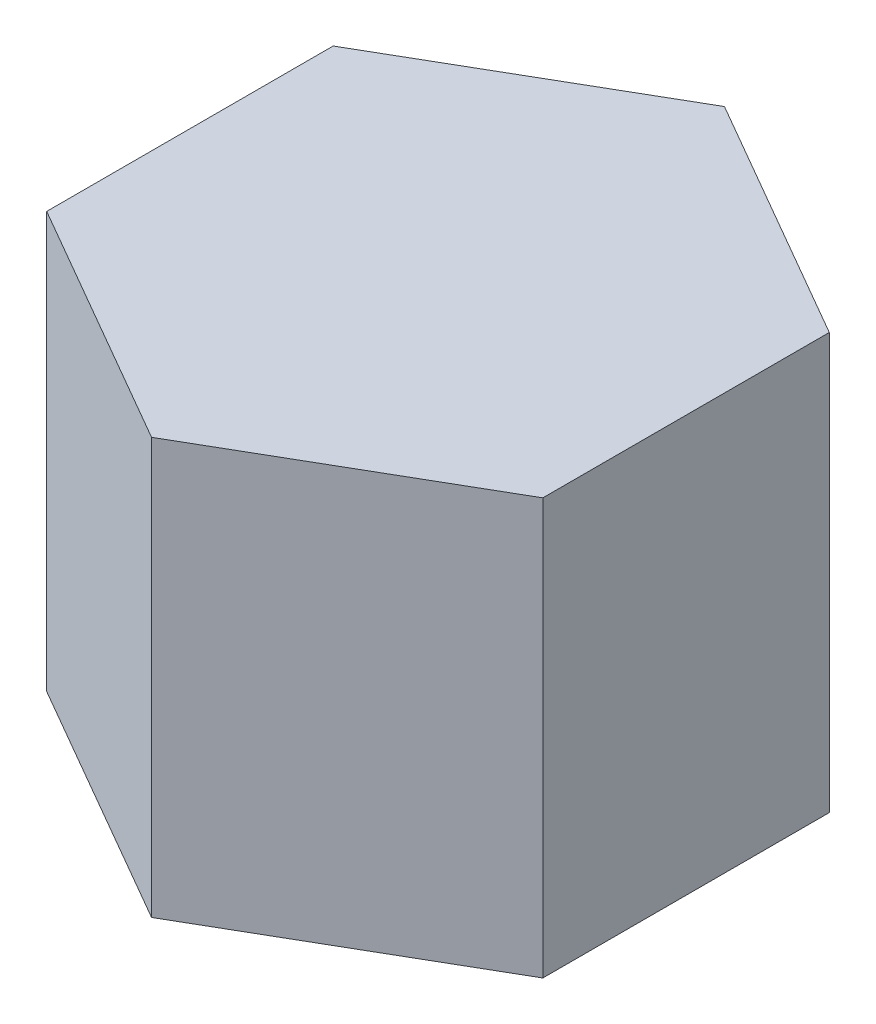
ISO-10303-21;
HEADER;
FILE_DESCRIPTION(('STEP AP214'),'2;1');
FILE_NAME('part.step','',(''),(''),'','','');
FILE_SCHEMA(('AUTOMOTIVE_DESIGN { 1 0 10303 214 1 1 1 1 }'));
ENDSEC;
DATA;
#1=APPLICATION_CONTEXT('core data for automotive mechanical design processes');
#2=APPLICATION_PROTOCOL_DEFINITION('international standard','automotive_design',2000,#1);
#3=PRODUCT_CONTEXT('',#1,'mechanical');
#4=PRODUCT('Part','Part','',(#3));
#5=PRODUCT_RELATED_PRODUCT_CATEGORY('part','',(#4));
#6=PRODUCT_DEFINITION_FORMATION('','',#4);
#7=PRODUCT_DEFINITION_CONTEXT('part definition',#1,'design');
#8=PRODUCT_DEFINITION('design','',#6,#7);
#9=PRODUCT_DEFINITION_SHAPE('','',#8);
#10=(LENGTH_UNIT() NAMED_UNIT(*) SI_UNIT(.MILLI.,.METRE.));
#11=(NAMED_UNIT(*) PLANE_ANGLE_UNIT() SI_UNIT($,.RADIAN.));
#12=(NAMED_UNIT(*) SI_UNIT($,.STERADIAN.) SOLID_ANGLE_UNIT());
#13=UNCERTAINTY_MEASURE_WITH_UNIT(LENGTH_MEASURE(1.E-05),#10,'distance_accuracy_value','');
#14=(GEOMETRIC_REPRESENTATION_CONTEXT(3) GLOBAL_UNCERTAINTY_ASSIGNED_CONTEXT((#13)) GLOBAL_UNIT_ASSIGNED_CONTEXT((#10,
#11,#12)) REPRESENTATION_CONTEXT('',''));
#15=CARTESIAN_POINT('',(0.,0.,0.));
#16=DIRECTION('',(0.,0.,1.));
#17=DIRECTION('',(1.,0.,0.));
#18=AXIS2_PLACEMENT_3D('',#15,#16,#17);
#19=CARTESIAN_POINT('',(211.142660308706,-148.537700895744,292.372996624279));
#20=DIRECTION('',(-0.499999999999943,0.,-0.866025403784472));
#21=DIRECTION('',(-0.866025403784472,0.,0.499999999999943));
#22=AXIS2_PLACEMENT_3D('',#19,#20,#21);
#23=PLANE('',#22);
#24=CARTESIAN_POINT('',(210.839551417382,-149.045793579175,292.547996624279));
#25=DIRECTION('',(0.866025403784471,0.,-0.499999999999943));
#26=VECTOR('',#25,1.);
#27=LINE('',#24,#26);
#28=CARTESIAN_POINT('',(210.839551417382,-149.045793579175,292.547996624279));
#29=VERTEX_POINT('',#28);
#30=CARTESIAN_POINT('',(211.142660308706,-149.045793579175,292.372996624279));
#31=VERTEX_POINT('',#30);
#32=EDGE_CURVE('E170',#29,#31,#27,.T.);
#33=ORIENTED_EDGE('',*,*,#32,.T.);
#34=CARTESIAN_POINT('',(211.142660308706,-148.537700895744,292.372996624279));
#35=DIRECTION('',(0.,-1.,0.));
#36=VECTOR('',#35,1.);
#37=LINE('',#34,#36);
#38=CARTESIAN_POINT('',(211.142660308706,-148.537700895744,292.372996624279));
#39=VERTEX_POINT('',#38);
#40=EDGE_CURVE('E35',#39,#31,#37,.T.);
#41=ORIENTED_EDGE('',*,*,#40,.F.);
#42=CARTESIAN_POINT('',(210.839551417382,-148.537700895744,292.547996624279));
#43=DIRECTION('',(0.866025403784471,0.,-0.499999999999943));
#44=VECTOR('',#43,1.);
#45=LINE('',#42,#44);
#46=CARTESIAN_POINT('',(210.839551417382,-148.537700895744,292.547996624279));
#47=VERTEX_POINT('',#46);
#48=EDGE_CURVE('E159',#47,#39,#45,.T.);
#49=ORIENTED_EDGE('',*,*,#48,.F.);
#50=CARTESIAN_POINT('',(210.839551417382,-148.537700895744,292.547996624279));
#51=DIRECTION('',(0.,-1.,0.));
#52=VECTOR('',#51,1.);
#53=LINE('',#50,#52);
#54=EDGE_CURVE('E10',#47,#29,#53,.T.);
#55=ORIENTED_EDGE('',*,*,#54,.T.);
#56=EDGE_LOOP('',(#33,#41,#49,#55));
#57=FACE_BOUND('',#56,.T.);
#58=ADVANCED_FACE('F16',(#57),#23,.F.);
#59=CARTESIAN_POINT('',(210.839551417382,-148.537700895744,292.547996624279));
#60=DIRECTION('',(0.500000000000062,0.,-0.866025403784403));
#61=DIRECTION('',(-0.866025403784403,0.,-0.500000000000062));
#62=AXIS2_PLACEMENT_3D('',#59,#60,#61);
#63=PLANE('',#62);
#64=CARTESIAN_POINT('',(210.536442526057,-149.045793579175,292.372996624279));
#65=DIRECTION('',(0.866025403784403,0.,0.500000000000062));
#66=VECTOR('',#65,1.);
#67=LINE('',#64,#66);
#68=CARTESIAN_POINT('',(210.536442526057,-149.045793579175,292.372996624279));
#69=VERTEX_POINT('',#68);
#70=EDGE_CURVE('E167',#69,#29,#67,.T.);
#71=ORIENTED_EDGE('',*,*,#70,.T.);
#72=ORIENTED_EDGE('',*,*,#54,.F.);
#73=CARTESIAN_POINT('',(210.536442526057,-148.537700895744,292.372996624279));
#74=DIRECTION('',(0.866025403784403,0.,0.500000000000062));
#75=VECTOR('',#74,1.);
#76=LINE('',#73,#75);
#77=CARTESIAN_POINT('',(210.536442526057,-148.537700895744,292.372996624279));
#78=VERTEX_POINT('',#77);
#79=EDGE_CURVE('E156',#78,#47,#76,.T.);
#80=ORIENTED_EDGE('',*,*,#79,.F.);
#81=CARTESIAN_POINT('',(210.536442526057,-148.537700895744,292.372996624279));
#82=DIRECTION('',(0.,-1.,0.));
#83=VECTOR('',#82,1.);
#84=LINE('',#81,#83);
#85=EDGE_CURVE('E27',#78,#69,#84,.T.);
#86=ORIENTED_EDGE('',*,*,#85,.T.);
#87=EDGE_LOOP('',(#71,#72,#80,#86));
#88=FACE_BOUND('',#87,.T.);
#89=ADVANCED_FACE('F189',(#88),#63,.F.);
#90=CARTESIAN_POINT('',(210.536442526057,-148.537700895744,290.831971220494));
#91=DIRECTION('',(1.,0.,0.));
#92=DIRECTION('',(0.,1.,0.));
#93=AXIS2_PLACEMENT_3D('',#90,#91,#92);
#94=PLANE('',#93);
#95=CARTESIAN_POINT('',(210.536442526057,-149.045793579175,292.022996624279));
#96=DIRECTION('',(0.,0.,1.));
#97=VECTOR('',#96,1.);
#98=LINE('',#95,#97);
#99=CARTESIAN_POINT('',(210.536442526057,-149.045793579175,292.022996624279));
#100=VERTEX_POINT('',#99);
#101=EDGE_CURVE('E163',#100,#69,#98,.T.);
#102=ORIENTED_EDGE('',*,*,#101,.T.);
#103=ORIENTED_EDGE('',*,*,#85,.F.);
#104=CARTESIAN_POINT('',(210.536442526057,-148.537700895744,292.022996624279));
#105=DIRECTION('',(0.,0.,1.));
#106=VECTOR('',#105,1.);
#107=LINE('',#104,#106);
#108=CARTESIAN_POINT('',(210.536442526057,-148.537700895744,292.022996624279));
#109=VERTEX_POINT('',#108);
#110=EDGE_CURVE('E106',#109,#78,#107,.T.);
#111=ORIENTED_EDGE('',*,*,#110,.F.);
#112=CARTESIAN_POINT('',(210.536442526057,-148.537700895744,292.022996624279));
#113=DIRECTION('',(0.,-1.,0.));
#114=VECTOR('',#113,1.);
#115=LINE('',#112,#114);
#116=EDGE_CURVE('E94',#109,#100,#115,.T.);
#117=ORIENTED_EDGE('',*,*,#116,.T.);
#118=EDGE_LOOP('',(#102,#103,#111,#117));
#119=FACE_BOUND('',#118,.T.);
#120=ADVANCED_FACE('F198',(#119),#94,.F.);
#121=CARTESIAN_POINT('',(210.536442526057,-148.537700895744,292.022996624279));
#122=DIRECTION('',(0.499999999999943,0.,0.866025403784472));
#123=DIRECTION('',(0.866025403784472,0.,-0.499999999999943));
#124=AXIS2_PLACEMENT_3D('',#121,#122,#123);
#125=PLANE('',#124);
#126=CARTESIAN_POINT('',(210.839551417382,-149.045793579175,291.847996624279));
#127=DIRECTION('',(-0.866025403784471,0.,0.499999999999943));
#128=VECTOR('',#127,1.);
#129=LINE('',#126,#128);
#130=CARTESIAN_POINT('',(210.839551417382,-149.045793579175,291.847996624279));
#131=VERTEX_POINT('',#130);
#132=EDGE_CURVE('E162',#131,#100,#129,.T.);
#133=ORIENTED_EDGE('',*,*,#132,.T.);
#134=ORIENTED_EDGE('',*,*,#116,.F.);
#135=CARTESIAN_POINT('',(210.839551417382,-148.537700895744,291.847996624279));
#136=DIRECTION('',(-0.866025403784471,0.,0.499999999999943));
#137=VECTOR('',#136,1.);
#138=LINE('',#135,#137);
#139=CARTESIAN_POINT('',(210.839551417382,-148.537700895744,291.847996624279));
#140=VERTEX_POINT('',#139);
#141=EDGE_CURVE('E98',#140,#109,#138,.T.);
#142=ORIENTED_EDGE('',*,*,#141,.F.);
#143=CARTESIAN_POINT('',(210.839551417382,-148.537700895744,291.847996624279));
#144=DIRECTION('',(0.,-1.,0.));
#145=VECTOR('',#144,1.);
#146=LINE('',#143,#145);
#147=EDGE_CURVE('E79',#140,#131,#146,.T.);
#148=ORIENTED_EDGE('',*,*,#147,.T.);
#149=EDGE_LOOP('',(#133,#134,#142,#148));
#150=FACE_BOUND('',#149,.T.);
#151=ADVANCED_FACE('F100',(#150),#125,.F.);
#152=CARTESIAN_POINT('',(210.839551417382,-148.537700895744,291.847996624279));
#153=DIRECTION('',(-0.500000000000062,0.,0.866025403784403));
#154=DIRECTION('',(0.866025403784403,0.,0.500000000000062));
#155=AXIS2_PLACEMENT_3D('',#152,#153,#154);
#156=PLANE('',#155);
#157=CARTESIAN_POINT('',(211.142660308706,-149.045793579175,292.022996624279));
#158=DIRECTION('',(-0.866025403784403,0.,-0.500000000000062));
#159=VECTOR('',#158,1.);
#160=LINE('',#157,#159);
#161=CARTESIAN_POINT('',(211.142660308706,-149.045793579175,292.022996624279));
#162=VERTEX_POINT('',#161);
#163=EDGE_CURVE('E88',#162,#131,#160,.T.);
#164=ORIENTED_EDGE('',*,*,#163,.T.);
#165=ORIENTED_EDGE('',*,*,#147,.F.);
#166=CARTESIAN_POINT('',(211.142660308706,-148.537700895744,292.022996624279));
#167=DIRECTION('',(-0.866025403784403,0.,-0.500000000000062));
#168=VECTOR('',#167,1.);
#169=LINE('',#166,#168);
#170=CARTESIAN_POINT('',(211.142660308706,-148.537700895744,292.022996624279));
#171=VERTEX_POINT('',#170);
#172=EDGE_CURVE('E84',#171,#140,#169,.T.);
#173=ORIENTED_EDGE('',*,*,#172,.F.);
#174=CARTESIAN_POINT('',(211.142660308706,-148.537700895744,292.022996624279));
#175=DIRECTION('',(0.,-1.,0.));
#176=VECTOR('',#175,1.);
#177=LINE('',#174,#176);
#178=EDGE_CURVE('E58',#171,#162,#177,.T.);
#179=ORIENTED_EDGE('',*,*,#178,.T.);
#180=EDGE_LOOP('',(#164,#165,#173,#179));
#181=FACE_BOUND('',#180,.T.);
#182=ADVANCED_FACE('F82',(#181),#156,.F.);
#183=CARTESIAN_POINT('',(211.142660308706,-148.537700895744,290.831971220494));
#184=DIRECTION('',(-1.,0.,0.));
#185=DIRECTION('',(0.,-1.,0.));
#186=AXIS2_PLACEMENT_3D('',#183,#184,#185);
#187=PLANE('',#186);
#188=CARTESIAN_POINT('',(211.142660308706,-149.045793579175,292.372996624279));
#189=DIRECTION('',(0.,0.,-1.));
#190=VECTOR('',#189,1.);
#191=LINE('',#188,#190);
#192=EDGE_CURVE('E160',#31,#162,#191,.T.);
#193=ORIENTED_EDGE('',*,*,#192,.T.);
#194=ORIENTED_EDGE('',*,*,#178,.F.);
#195=CARTESIAN_POINT('',(211.142660308706,-148.537700895744,292.372996624279));
#196=DIRECTION('',(0.,0.,-1.));
#197=VECTOR('',#196,1.);
#198=LINE('',#195,#197);
#199=EDGE_CURVE('E112',#39,#171,#198,.T.);
#200=ORIENTED_EDGE('',*,*,#199,.F.);
#201=ORIENTED_EDGE('',*,*,#40,.T.);
#202=EDGE_LOOP('',(#193,#194,#200,#201));
#203=FACE_BOUND('',#202,.T.);
#204=ADVANCED_FACE('F131',(#203),#187,.F.);
#205=CARTESIAN_POINT('',(206.339551417382,-148.537700895744,290.831971220494));
#206=DIRECTION('',(0.,-1.,0.));
#207=DIRECTION('',(1.,0.,0.));
#208=AXIS2_PLACEMENT_3D('',#205,#206,#207);
#209=PLANE('',#208);
#210=ORIENTED_EDGE('',*,*,#48,.T.);
#211=ORIENTED_EDGE('',*,*,#199,.T.);
#212=ORIENTED_EDGE('',*,*,#172,.T.);
#213=ORIENTED_EDGE('',*,*,#141,.T.);
#214=ORIENTED_EDGE('',*,*,#110,.T.);
#215=ORIENTED_EDGE('',*,*,#79,.T.);
#216=EDGE_LOOP('',(#210,#211,#212,#213,#214,#215));
#217=FACE_BOUND('',#216,.T.);
#218=ADVANCED_FACE('F111',(#217),#209,.F.);
#219=CARTESIAN_POINT('',(206.339551417382,-149.045793579175,290.831971220494));
#220=DIRECTION('',(0.,-1.,0.));
#221=DIRECTION('',(1.,0.,0.));
#222=AXIS2_PLACEMENT_3D('',#219,#220,#221);
#223=PLANE('',#222);
#224=ORIENTED_EDGE('',*,*,#32,.F.);
#225=ORIENTED_EDGE('',*,*,#70,.F.);
#226=ORIENTED_EDGE('',*,*,#101,.F.);
#227=ORIENTED_EDGE('',*,*,#132,.F.);
#228=ORIENTED_EDGE('',*,*,#163,.F.);
#229=ORIENTED_EDGE('',*,*,#192,.F.);
#230=EDGE_LOOP('',(#224,#225,#226,#227,#228,#229));
#231=FACE_BOUND('',#230,.T.);
#232=ADVANCED_FACE('F130',(#231),#223,.T.);
#233=CLOSED_SHELL('',(#58,#89,#120,#151,#182,#204,#218,#232));
#234=MANIFOLD_SOLID_BREP('B1',#233);
#235=ADVANCED_BREP_SHAPE_REPRESENTATION('',(#18,#234),#14);
#236=SHAPE_DEFINITION_REPRESENTATION(#9,#235);
ENDSEC;
END-ISO-10303-21;
